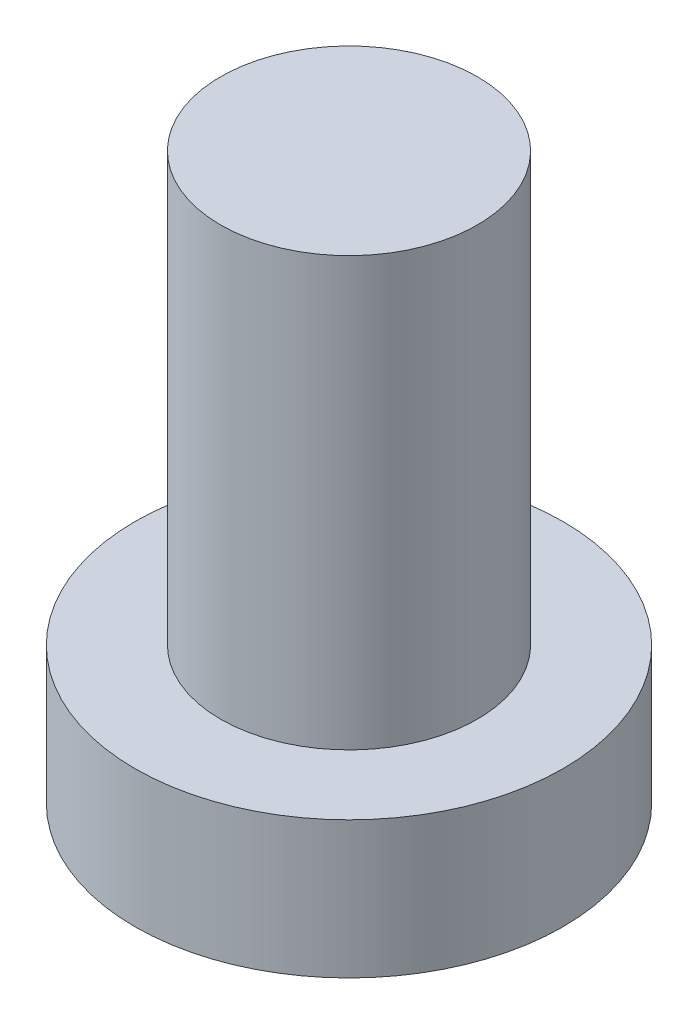
ISO-10303-21;
HEADER;
FILE_DESCRIPTION(('STEP AP214'),'2;1');
FILE_NAME('part.step','',(''),(''),'','','');
FILE_SCHEMA(('AUTOMOTIVE_DESIGN { 1 0 10303 214 1 1 1 1 }'));
ENDSEC;
DATA;
#1=APPLICATION_CONTEXT('core data for automotive mechanical design processes');
#2=APPLICATION_PROTOCOL_DEFINITION('international standard','automotive_design',2000,#1);
#3=PRODUCT_CONTEXT('',#1,'mechanical');
#4=PRODUCT('Part','Part','',(#3));
#5=PRODUCT_RELATED_PRODUCT_CATEGORY('part','',(#4));
#6=PRODUCT_DEFINITION_FORMATION('','',#4);
#7=PRODUCT_DEFINITION_CONTEXT('part definition',#1,'design');
#8=PRODUCT_DEFINITION('design','',#6,#7);
#9=PRODUCT_DEFINITION_SHAPE('','',#8);
#10=(LENGTH_UNIT() NAMED_UNIT(*) SI_UNIT(.MILLI.,.METRE.));
#11=(NAMED_UNIT(*) PLANE_ANGLE_UNIT() SI_UNIT($,.RADIAN.));
#12=(NAMED_UNIT(*) SI_UNIT($,.STERADIAN.) SOLID_ANGLE_UNIT());
#13=UNCERTAINTY_MEASURE_WITH_UNIT(LENGTH_MEASURE(1.E-05),#10,'distance_accuracy_value','');
#14=(GEOMETRIC_REPRESENTATION_CONTEXT(3) GLOBAL_UNCERTAINTY_ASSIGNED_CONTEXT((#13)) GLOBAL_UNIT_ASSIGNED_CONTEXT((#10,
#11,#12)) REPRESENTATION_CONTEXT('',''));
#15=CARTESIAN_POINT('',(0.,0.,0.));
#16=DIRECTION('',(0.,0.,1.));
#17=DIRECTION('',(1.,0.,0.));
#18=AXIS2_PLACEMENT_3D('',#15,#16,#17);
#19=CARTESIAN_POINT('',(0.,0.,0.));
#20=DIRECTION('',(0.,1.,0.));
#21=DIRECTION('',(0.,0.,1.));
#22=AXIS2_PLACEMENT_3D('',#19,#20,#21);
#23=PLANE('',#22);
#24=CARTESIAN_POINT('',(0.,0.,0.));
#25=DIRECTION('',(0.,1.,0.));
#26=DIRECTION('',(0.,0.,1.));
#27=AXIS2_PLACEMENT_3D('',#24,#25,#26);
#28=CIRCLE('',#27,2.5);
#29=CARTESIAN_POINT('',(0.,0.,2.5));
#30=VERTEX_POINT('',#29);
#31=EDGE_CURVE('E39',#30,#30,#28,.T.);
#32=ORIENTED_EDGE('',*,*,#31,.F.);
#33=EDGE_LOOP('',(#32));
#34=FACE_BOUND('',#33,.T.);
#35=CARTESIAN_POINT('',(1.,0.,1.));
#36=DIRECTION('',(0.,1.,0.));
#37=DIRECTION('',(0.,0.,-1.));
#38=AXIS2_PLACEMENT_3D('',#35,#36,#37);
#39=CIRCLE('',#38,0.5);
#40=CARTESIAN_POINT('',(1.,0.,0.5));
#41=VERTEX_POINT('',#40);
#42=CARTESIAN_POINT('',(0.5,0.,1.));
#43=VERTEX_POINT('',#42);
#44=EDGE_CURVE('E186',#41,#43,#39,.T.);
#45=ORIENTED_EDGE('',*,*,#44,.F.);
#46=DIRECTION('',(-1.,0.,0.));
#47=VECTOR('',#46,1.);
#48=CARTESIAN_POINT('',(1.,0.,0.5));
#49=LINE('',#48,#47);
#50=CARTESIAN_POINT('',(1.75,0.,0.5));
#51=VERTEX_POINT('',#50);
#52=EDGE_CURVE('E52',#51,#41,#49,.T.);
#53=ORIENTED_EDGE('',*,*,#52,.F.);
#54=DIRECTION('',(0.,0.,1.));
#55=VECTOR('',#54,1.);
#56=CARTESIAN_POINT('',(1.75,0.,-0.5));
#57=LINE('',#56,#55);
#58=CARTESIAN_POINT('',(1.75,0.,-0.5));
#59=VERTEX_POINT('',#58);
#60=EDGE_CURVE('E225',#59,#51,#57,.T.);
#61=ORIENTED_EDGE('',*,*,#60,.F.);
#62=DIRECTION('',(1.,0.,0.));
#63=VECTOR('',#62,1.);
#64=CARTESIAN_POINT('',(1.,0.,-0.5));
#65=LINE('',#64,#63);
#66=CARTESIAN_POINT('',(1.,0.,-0.5));
#67=VERTEX_POINT('',#66);
#68=EDGE_CURVE('E223',#67,#59,#65,.T.);
#69=ORIENTED_EDGE('',*,*,#68,.F.);
#70=CARTESIAN_POINT('',(1.,0.,-1.));
#71=DIRECTION('',(0.,1.,0.));
#72=DIRECTION('',(0.,0.,-1.));
#73=AXIS2_PLACEMENT_3D('',#70,#71,#72);
#74=CIRCLE('',#73,0.5);
#75=CARTESIAN_POINT('',(0.5,0.,-1.));
#76=VERTEX_POINT('',#75);
#77=EDGE_CURVE('E160',#76,#67,#74,.T.);
#78=ORIENTED_EDGE('',*,*,#77,.F.);
#79=DIRECTION('',(0.,0.,1.));
#80=VECTOR('',#79,1.);
#81=CARTESIAN_POINT('',(0.5,0.,-1.75));
#82=LINE('',#81,#80);
#83=CARTESIAN_POINT('',(0.5,0.,-1.75));
#84=VERTEX_POINT('',#83);
#85=EDGE_CURVE('E219',#84,#76,#82,.T.);
#86=ORIENTED_EDGE('',*,*,#85,.F.);
#87=DIRECTION('',(1.,0.,0.));
#88=VECTOR('',#87,1.);
#89=CARTESIAN_POINT('',(-0.5,0.,-1.75));
#90=LINE('',#89,#88);
#91=CARTESIAN_POINT('',(-0.5,0.,-1.75));
#92=VERTEX_POINT('',#91);
#93=EDGE_CURVE('E216',#92,#84,#90,.T.);
#94=ORIENTED_EDGE('',*,*,#93,.F.);
#95=DIRECTION('',(0.,0.,-1.));
#96=VECTOR('',#95,1.);
#97=CARTESIAN_POINT('',(-0.5,0.,-1.75));
#98=LINE('',#97,#96);
#99=CARTESIAN_POINT('',(-0.5,0.,-1.));
#100=VERTEX_POINT('',#99);
#101=EDGE_CURVE('E213',#100,#92,#98,.T.);
#102=ORIENTED_EDGE('',*,*,#101,.F.);
#103=CARTESIAN_POINT('',(-1.,0.,-1.));
#104=DIRECTION('',(0.,1.,0.));
#105=DIRECTION('',(0.,0.,-1.));
#106=AXIS2_PLACEMENT_3D('',#103,#104,#105);
#107=CIRCLE('',#106,0.5);
#108=CARTESIAN_POINT('',(-1.,0.,-0.5));
#109=VERTEX_POINT('',#108);
#110=EDGE_CURVE('E210',#109,#100,#107,.T.);
#111=ORIENTED_EDGE('',*,*,#110,.F.);
#112=DIRECTION('',(1.,0.,0.));
#113=VECTOR('',#112,1.);
#114=CARTESIAN_POINT('',(-1.75,0.,-0.5));
#115=LINE('',#114,#113);
#116=CARTESIAN_POINT('',(-1.75,0.,-0.5));
#117=VERTEX_POINT('',#116);
#118=EDGE_CURVE('E207',#117,#109,#115,.T.);
#119=ORIENTED_EDGE('',*,*,#118,.F.);
#120=DIRECTION('',(0.,0.,-1.));
#121=VECTOR('',#120,1.);
#122=CARTESIAN_POINT('',(-1.75,0.,-0.5));
#123=LINE('',#122,#121);
#124=CARTESIAN_POINT('',(-1.75,0.,0.5));
#125=VERTEX_POINT('',#124);
#126=EDGE_CURVE('E204',#125,#117,#123,.T.);
#127=ORIENTED_EDGE('',*,*,#126,.F.);
#128=DIRECTION('',(-1.,0.,0.));
#129=VECTOR('',#128,1.);
#130=CARTESIAN_POINT('',(-1.75,0.,0.5));
#131=LINE('',#130,#129);
#132=CARTESIAN_POINT('',(-1.,0.,0.5));
#133=VERTEX_POINT('',#132);
#134=EDGE_CURVE('E201',#133,#125,#131,.T.);
#135=ORIENTED_EDGE('',*,*,#134,.F.);
#136=CARTESIAN_POINT('',(-1.,0.,1.));
#137=DIRECTION('',(0.,1.,0.));
#138=DIRECTION('',(0.,0.,1.));
#139=AXIS2_PLACEMENT_3D('',#136,#137,#138);
#140=CIRCLE('',#139,0.5);
#141=CARTESIAN_POINT('',(-0.5,0.,1.));
#142=VERTEX_POINT('',#141);
#143=EDGE_CURVE('E198',#142,#133,#140,.T.);
#144=ORIENTED_EDGE('',*,*,#143,.F.);
#145=DIRECTION('',(0.,0.,-1.));
#146=VECTOR('',#145,1.);
#147=CARTESIAN_POINT('',(-0.5,0.,1.));
#148=LINE('',#147,#146);
#149=CARTESIAN_POINT('',(-0.5,0.,1.75));
#150=VERTEX_POINT('',#149);
#151=EDGE_CURVE('E195',#150,#142,#148,.T.);
#152=ORIENTED_EDGE('',*,*,#151,.F.);
#153=DIRECTION('',(-1.,0.,0.));
#154=VECTOR('',#153,1.);
#155=CARTESIAN_POINT('',(-0.5,0.,1.75));
#156=LINE('',#155,#154);
#157=CARTESIAN_POINT('',(0.5,0.,1.75));
#158=VERTEX_POINT('',#157);
#159=EDGE_CURVE('E192',#158,#150,#156,.T.);
#160=ORIENTED_EDGE('',*,*,#159,.F.);
#161=DIRECTION('',(0.,0.,1.));
#162=VECTOR('',#161,1.);
#163=CARTESIAN_POINT('',(0.5,0.,1.));
#164=LINE('',#163,#162);
#165=EDGE_CURVE('E189',#43,#158,#164,.T.);
#166=ORIENTED_EDGE('',*,*,#165,.F.);
#167=EDGE_LOOP('',(#45,#53,#61,#69,#78,#86,#94,#102,#111,#119,#127,#135,#144,#152,#160,#166));
#168=FACE_BOUND('',#167,.T.);
#169=ADVANCED_FACE('F35',(#34,#168),#23,.F.);
#170=CARTESIAN_POINT('',(0.,1.6,0.));
#171=DIRECTION('',(0.,-1.,0.));
#172=DIRECTION('',(0.,0.,-1.));
#173=AXIS2_PLACEMENT_3D('',#170,#171,#172);
#174=CYLINDRICAL_SURFACE('',#173,2.5);
#175=CARTESIAN_POINT('',(0.,1.6,0.));
#176=DIRECTION('',(0.,1.,0.));
#177=DIRECTION('',(0.,0.,1.));
#178=AXIS2_PLACEMENT_3D('',#175,#176,#177);
#179=CIRCLE('',#178,2.5);
#180=CARTESIAN_POINT('',(0.,1.6,2.5));
#181=VERTEX_POINT('',#180);
#182=EDGE_CURVE('E44',#181,#181,#179,.T.);
#183=ORIENTED_EDGE('',*,*,#182,.F.);
#184=EDGE_LOOP('',(#183));
#185=FACE_BOUND('',#184,.T.);
#186=ORIENTED_EDGE('',*,*,#31,.T.);
#187=EDGE_LOOP('',(#186));
#188=FACE_BOUND('',#187,.T.);
#189=ADVANCED_FACE('F37',(#185,#188),#174,.T.);
#190=CARTESIAN_POINT('',(0.,1.6,0.));
#191=DIRECTION('',(0.,1.,0.));
#192=DIRECTION('',(0.,0.,1.));
#193=AXIS2_PLACEMENT_3D('',#190,#191,#192);
#194=PLANE('',#193);
#195=CARTESIAN_POINT('',(0.,1.6,0.));
#196=DIRECTION('',(0.,1.,0.));
#197=DIRECTION('',(0.,0.,1.));
#198=AXIS2_PLACEMENT_3D('',#195,#196,#197);
#199=CIRCLE('',#198,1.5);
#200=CARTESIAN_POINT('',(0.,1.6,1.5));
#201=VERTEX_POINT('',#200);
#202=EDGE_CURVE('E11',#201,#201,#199,.T.);
#203=ORIENTED_EDGE('',*,*,#202,.F.);
#204=EDGE_LOOP('',(#203));
#205=FACE_BOUND('',#204,.T.);
#206=ORIENTED_EDGE('',*,*,#182,.T.);
#207=EDGE_LOOP('',(#206));
#208=FACE_BOUND('',#207,.T.);
#209=ADVANCED_FACE('F374',(#205,#208),#194,.T.);
#210=CARTESIAN_POINT('',(0.,6.6,0.));
#211=DIRECTION('',(0.,-1.,0.));
#212=DIRECTION('',(0.,0.,-1.));
#213=AXIS2_PLACEMENT_3D('',#210,#211,#212);
#214=CYLINDRICAL_SURFACE('',#213,1.5);
#215=CARTESIAN_POINT('',(0.,6.6,0.));
#216=DIRECTION('',(0.,1.,0.));
#217=DIRECTION('',(0.,0.,1.));
#218=AXIS2_PLACEMENT_3D('',#215,#216,#217);
#219=CIRCLE('',#218,1.5);
#220=CARTESIAN_POINT('',(0.,6.6,1.5));
#221=VERTEX_POINT('',#220);
#222=EDGE_CURVE('E229',#221,#221,#219,.T.);
#223=ORIENTED_EDGE('',*,*,#222,.F.);
#224=EDGE_LOOP('',(#223));
#225=FACE_BOUND('',#224,.T.);
#226=ORIENTED_EDGE('',*,*,#202,.T.);
#227=EDGE_LOOP('',(#226));
#228=FACE_BOUND('',#227,.T.);
#229=ADVANCED_FACE('F370',(#225,#228),#214,.T.);
#230=CARTESIAN_POINT('',(0.,6.6,0.));
#231=DIRECTION('',(0.,1.,0.));
#232=DIRECTION('',(0.,0.,1.));
#233=AXIS2_PLACEMENT_3D('',#230,#231,#232);
#234=PLANE('',#233);
#235=ORIENTED_EDGE('',*,*,#222,.T.);
#236=EDGE_LOOP('',(#235));
#237=FACE_BOUND('',#236,.T.);
#238=ADVANCED_FACE('F320',(#237),#234,.T.);
#239=CARTESIAN_POINT('',(1.,1.,0.5));
#240=DIRECTION('',(0.,0.,1.));
#241=DIRECTION('',(1.,0.,0.));
#242=AXIS2_PLACEMENT_3D('',#239,#240,#241);
#243=PLANE('',#242);
#244=ORIENTED_EDGE('',*,*,#52,.T.);
#245=DIRECTION('',(0.,-1.,0.));
#246=VECTOR('',#245,1.);
#247=CARTESIAN_POINT('',(1.,1.,0.5));
#248=LINE('',#247,#246);
#249=CARTESIAN_POINT('',(1.,1.,0.5));
#250=VERTEX_POINT('',#249);
#251=EDGE_CURVE('E112',#250,#41,#248,.T.);
#252=ORIENTED_EDGE('',*,*,#251,.F.);
#253=DIRECTION('',(-1.,0.,0.));
#254=VECTOR('',#253,1.);
#255=CARTESIAN_POINT('',(1.,1.,0.5));
#256=LINE('',#255,#254);
#257=CARTESIAN_POINT('',(1.75,1.,0.5));
#258=VERTEX_POINT('',#257);
#259=EDGE_CURVE('E227',#258,#250,#256,.T.);
#260=ORIENTED_EDGE('',*,*,#259,.F.);
#261=DIRECTION('',(0.,-1.,0.));
#262=VECTOR('',#261,1.);
#263=CARTESIAN_POINT('',(1.75,1.,0.5));
#264=LINE('',#263,#262);
#265=EDGE_CURVE('E60',#258,#51,#264,.T.);
#266=ORIENTED_EDGE('',*,*,#265,.T.);
#267=EDGE_LOOP('',(#244,#252,#260,#266));
#268=FACE_BOUND('',#267,.T.);
#269=ADVANCED_FACE('F313',(#268),#243,.F.);
#270=CARTESIAN_POINT('',(1.75,1.,-0.5));
#271=DIRECTION('',(1.,0.,0.));
#272=DIRECTION('',(0.,0.,-1.));
#273=AXIS2_PLACEMENT_3D('',#270,#271,#272);
#274=PLANE('',#273);
#275=ORIENTED_EDGE('',*,*,#60,.T.);
#276=ORIENTED_EDGE('',*,*,#265,.F.);
#277=DIRECTION('',(0.,0.,1.));
#278=VECTOR('',#277,1.);
#279=CARTESIAN_POINT('',(1.75,1.,-0.5));
#280=LINE('',#279,#278);
#281=CARTESIAN_POINT('',(1.75,1.,-0.5));
#282=VERTEX_POINT('',#281);
#283=EDGE_CURVE('E172',#282,#258,#280,.T.);
#284=ORIENTED_EDGE('',*,*,#283,.F.);
#285=DIRECTION('',(0.,-1.,0.));
#286=VECTOR('',#285,1.);
#287=CARTESIAN_POINT('',(1.75,1.,-0.5));
#288=LINE('',#287,#286);
#289=EDGE_CURVE('E164',#282,#59,#288,.T.);
#290=ORIENTED_EDGE('',*,*,#289,.T.);
#291=EDGE_LOOP('',(#275,#276,#284,#290));
#292=FACE_BOUND('',#291,.T.);
#293=ADVANCED_FACE('F311',(#292),#274,.F.);
#294=CARTESIAN_POINT('',(1.,1.,-0.5));
#295=DIRECTION('',(0.,0.,-1.));
#296=DIRECTION('',(-1.,0.,0.));
#297=AXIS2_PLACEMENT_3D('',#294,#295,#296);
#298=PLANE('',#297);
#299=ORIENTED_EDGE('',*,*,#68,.T.);
#300=ORIENTED_EDGE('',*,*,#289,.F.);
#301=DIRECTION('',(1.,0.,0.));
#302=VECTOR('',#301,1.);
#303=CARTESIAN_POINT('',(1.,1.,-0.5));
#304=LINE('',#303,#302);
#305=CARTESIAN_POINT('',(1.,1.,-0.5));
#306=VERTEX_POINT('',#305);
#307=EDGE_CURVE('E168',#306,#282,#304,.T.);
#308=ORIENTED_EDGE('',*,*,#307,.F.);
#309=DIRECTION('',(0.,-1.,0.));
#310=VECTOR('',#309,1.);
#311=CARTESIAN_POINT('',(1.,1.,-0.5));
#312=LINE('',#311,#310);
#313=EDGE_CURVE('E153',#306,#67,#312,.T.);
#314=ORIENTED_EDGE('',*,*,#313,.T.);
#315=EDGE_LOOP('',(#299,#300,#308,#314));
#316=FACE_BOUND('',#315,.T.);
#317=ADVANCED_FACE('F169',(#316),#298,.F.);
#318=CARTESIAN_POINT('',(1.,1.,-1.));
#319=DIRECTION('',(0.,-1.,0.));
#320=DIRECTION('',(0.,0.,-1.));
#321=AXIS2_PLACEMENT_3D('',#318,#319,#320);
#322=CYLINDRICAL_SURFACE('',#321,0.5);
#323=ORIENTED_EDGE('',*,*,#77,.T.);
#324=ORIENTED_EDGE('',*,*,#313,.F.);
#325=CARTESIAN_POINT('',(1.,1.,-1.));
#326=DIRECTION('',(0.,1.,0.));
#327=DIRECTION('',(0.,0.,-1.));
#328=AXIS2_PLACEMENT_3D('',#325,#326,#327);
#329=CIRCLE('',#328,0.5);
#330=CARTESIAN_POINT('',(0.5,1.,-1.));
#331=VERTEX_POINT('',#330);
#332=EDGE_CURVE('E157',#331,#306,#329,.T.);
#333=ORIENTED_EDGE('',*,*,#332,.F.);
#334=DIRECTION('',(0.,-1.,0.));
#335=VECTOR('',#334,1.);
#336=CARTESIAN_POINT('',(0.5,1.,-1.));
#337=LINE('',#336,#335);
#338=EDGE_CURVE('E165',#331,#76,#337,.T.);
#339=ORIENTED_EDGE('',*,*,#338,.T.);
#340=EDGE_LOOP('',(#323,#324,#333,#339));
#341=FACE_BOUND('',#340,.T.);
#342=ADVANCED_FACE('F155',(#341),#322,.T.);
#343=CARTESIAN_POINT('',(0.5,1.,-1.75));
#344=DIRECTION('',(1.,0.,0.));
#345=DIRECTION('',(0.,0.,-1.));
#346=AXIS2_PLACEMENT_3D('',#343,#344,#345);
#347=PLANE('',#346);
#348=ORIENTED_EDGE('',*,*,#85,.T.);
#349=ORIENTED_EDGE('',*,*,#338,.F.);
#350=DIRECTION('',(0.,0.,1.));
#351=VECTOR('',#350,1.);
#352=CARTESIAN_POINT('',(0.5,1.,-1.75));
#353=LINE('',#352,#351);
#354=CARTESIAN_POINT('',(0.5,1.,-1.75));
#355=VERTEX_POINT('',#354);
#356=EDGE_CURVE('E178',#355,#331,#353,.T.);
#357=ORIENTED_EDGE('',*,*,#356,.F.);
#358=DIRECTION('',(0.,-1.,0.));
#359=VECTOR('',#358,1.);
#360=CARTESIAN_POINT('',(0.5,1.,-1.75));
#361=LINE('',#360,#359);
#362=EDGE_CURVE('E232',#355,#84,#361,.T.);
#363=ORIENTED_EDGE('',*,*,#362,.T.);
#364=EDGE_LOOP('',(#348,#349,#357,#363));
#365=FACE_BOUND('',#364,.T.);
#366=ADVANCED_FACE('F310',(#365),#347,.F.);
#367=CARTESIAN_POINT('',(-0.5,1.,-1.75));
#368=DIRECTION('',(0.,0.,-1.));
#369=DIRECTION('',(-1.,0.,0.));
#370=AXIS2_PLACEMENT_3D('',#367,#368,#369);
#371=PLANE('',#370);
#372=ORIENTED_EDGE('',*,*,#93,.T.);
#373=ORIENTED_EDGE('',*,*,#362,.F.);
#374=DIRECTION('',(1.,0.,0.));
#375=VECTOR('',#374,1.);
#376=CARTESIAN_POINT('',(-0.5,1.,-1.75));
#377=LINE('',#376,#375);
#378=CARTESIAN_POINT('',(-0.5,1.,-1.75));
#379=VERTEX_POINT('',#378);
#380=EDGE_CURVE('E180',#379,#355,#377,.T.);
#381=ORIENTED_EDGE('',*,*,#380,.F.);
#382=DIRECTION('',(0.,-1.,0.));
#383=VECTOR('',#382,1.);
#384=CARTESIAN_POINT('',(-0.5,1.,-1.75));
#385=LINE('',#384,#383);
#386=EDGE_CURVE('E234',#379,#92,#385,.T.);
#387=ORIENTED_EDGE('',*,*,#386,.T.);
#388=EDGE_LOOP('',(#372,#373,#381,#387));
#389=FACE_BOUND('',#388,.T.);
#390=ADVANCED_FACE('F306',(#389),#371,.F.);
#391=CARTESIAN_POINT('',(-0.5,1.,-1.75));
#392=DIRECTION('',(-1.,0.,0.));
#393=DIRECTION('',(0.,0.,1.));
#394=AXIS2_PLACEMENT_3D('',#391,#392,#393);
#395=PLANE('',#394);
#396=ORIENTED_EDGE('',*,*,#101,.T.);
#397=ORIENTED_EDGE('',*,*,#386,.F.);
#398=DIRECTION('',(0.,0.,-1.));
#399=VECTOR('',#398,1.);
#400=CARTESIAN_POINT('',(-0.5,1.,-1.75));
#401=LINE('',#400,#399);
#402=CARTESIAN_POINT('',(-0.5,1.,-1.));
#403=VERTEX_POINT('',#402);
#404=EDGE_CURVE('E301',#403,#379,#401,.T.);
#405=ORIENTED_EDGE('',*,*,#404,.F.);
#406=DIRECTION('',(0.,-1.,0.));
#407=VECTOR('',#406,1.);
#408=CARTESIAN_POINT('',(-0.5,1.,-1.));
#409=LINE('',#408,#407);
#410=EDGE_CURVE('E236',#403,#100,#409,.T.);
#411=ORIENTED_EDGE('',*,*,#410,.T.);
#412=EDGE_LOOP('',(#396,#397,#405,#411));
#413=FACE_BOUND('',#412,.T.);
#414=ADVANCED_FACE('F330',(#413),#395,.F.);
#415=CARTESIAN_POINT('',(-1.,1.,-1.));
#416=DIRECTION('',(0.,-1.,0.));
#417=DIRECTION('',(0.,0.,-1.));
#418=AXIS2_PLACEMENT_3D('',#415,#416,#417);
#419=CYLINDRICAL_SURFACE('',#418,0.5);
#420=ORIENTED_EDGE('',*,*,#110,.T.);
#421=ORIENTED_EDGE('',*,*,#410,.F.);
#422=CARTESIAN_POINT('',(-1.,1.,-1.));
#423=DIRECTION('',(0.,1.,0.));
#424=DIRECTION('',(0.,0.,-1.));
#425=AXIS2_PLACEMENT_3D('',#422,#423,#424);
#426=CIRCLE('',#425,0.5);
#427=CARTESIAN_POINT('',(-1.,1.,-0.5));
#428=VERTEX_POINT('',#427);
#429=EDGE_CURVE('E298',#428,#403,#426,.T.);
#430=ORIENTED_EDGE('',*,*,#429,.F.);
#431=DIRECTION('',(0.,-1.,0.));
#432=VECTOR('',#431,1.);
#433=CARTESIAN_POINT('',(-1.,1.,-0.5));
#434=LINE('',#433,#432);
#435=EDGE_CURVE('E238',#428,#109,#434,.T.);
#436=ORIENTED_EDGE('',*,*,#435,.T.);
#437=EDGE_LOOP('',(#420,#421,#430,#436));
#438=FACE_BOUND('',#437,.T.);
#439=ADVANCED_FACE('F333',(#438),#419,.T.);
#440=CARTESIAN_POINT('',(-1.75,1.,-0.5));
#441=DIRECTION('',(0.,0.,-1.));
#442=DIRECTION('',(-1.,0.,0.));
#443=AXIS2_PLACEMENT_3D('',#440,#441,#442);
#444=PLANE('',#443);
#445=ORIENTED_EDGE('',*,*,#118,.T.);
#446=ORIENTED_EDGE('',*,*,#435,.F.);
#447=DIRECTION('',(1.,0.,0.));
#448=VECTOR('',#447,1.);
#449=CARTESIAN_POINT('',(-1.75,1.,-0.5));
#450=LINE('',#449,#448);
#451=CARTESIAN_POINT('',(-1.75,1.,-0.5));
#452=VERTEX_POINT('',#451);
#453=EDGE_CURVE('E295',#452,#428,#450,.T.);
#454=ORIENTED_EDGE('',*,*,#453,.F.);
#455=DIRECTION('',(0.,-1.,0.));
#456=VECTOR('',#455,1.);
#457=CARTESIAN_POINT('',(-1.75,1.,-0.5));
#458=LINE('',#457,#456);
#459=EDGE_CURVE('E240',#452,#117,#458,.T.);
#460=ORIENTED_EDGE('',*,*,#459,.T.);
#461=EDGE_LOOP('',(#445,#446,#454,#460));
#462=FACE_BOUND('',#461,.T.);
#463=ADVANCED_FACE('F337',(#462),#444,.F.);
#464=CARTESIAN_POINT('',(-1.75,1.,-0.5));
#465=DIRECTION('',(-1.,0.,0.));
#466=DIRECTION('',(0.,0.,1.));
#467=AXIS2_PLACEMENT_3D('',#464,#465,#466);
#468=PLANE('',#467);
#469=ORIENTED_EDGE('',*,*,#126,.T.);
#470=ORIENTED_EDGE('',*,*,#459,.F.);
#471=DIRECTION('',(0.,0.,-1.));
#472=VECTOR('',#471,1.);
#473=CARTESIAN_POINT('',(-1.75,1.,-0.5));
#474=LINE('',#473,#472);
#475=CARTESIAN_POINT('',(-1.75,1.,0.5));
#476=VERTEX_POINT('',#475);
#477=EDGE_CURVE('E292',#476,#452,#474,.T.);
#478=ORIENTED_EDGE('',*,*,#477,.F.);
#479=DIRECTION('',(0.,-1.,0.));
#480=VECTOR('',#479,1.);
#481=CARTESIAN_POINT('',(-1.75,1.,0.5));
#482=LINE('',#481,#480);
#483=EDGE_CURVE('E242',#476,#125,#482,.T.);
#484=ORIENTED_EDGE('',*,*,#483,.T.);
#485=EDGE_LOOP('',(#469,#470,#478,#484));
#486=FACE_BOUND('',#485,.T.);
#487=ADVANCED_FACE('F341',(#486),#468,.F.);
#488=CARTESIAN_POINT('',(-1.75,1.,0.5));
#489=DIRECTION('',(0.,0.,1.));
#490=DIRECTION('',(1.,0.,0.));
#491=AXIS2_PLACEMENT_3D('',#488,#489,#490);
#492=PLANE('',#491);
#493=ORIENTED_EDGE('',*,*,#134,.T.);
#494=ORIENTED_EDGE('',*,*,#483,.F.);
#495=DIRECTION('',(-1.,0.,0.));
#496=VECTOR('',#495,1.);
#497=CARTESIAN_POINT('',(-1.75,1.,0.5));
#498=LINE('',#497,#496);
#499=CARTESIAN_POINT('',(-1.,1.,0.5));
#500=VERTEX_POINT('',#499);
#501=EDGE_CURVE('E289',#500,#476,#498,.T.);
#502=ORIENTED_EDGE('',*,*,#501,.F.);
#503=DIRECTION('',(0.,-1.,0.));
#504=VECTOR('',#503,1.);
#505=CARTESIAN_POINT('',(-1.,1.,0.5));
#506=LINE('',#505,#504);
#507=EDGE_CURVE('E244',#500,#133,#506,.T.);
#508=ORIENTED_EDGE('',*,*,#507,.T.);
#509=EDGE_LOOP('',(#493,#494,#502,#508));
#510=FACE_BOUND('',#509,.T.);
#511=ADVANCED_FACE('F345',(#510),#492,.F.);
#512=CARTESIAN_POINT('',(-1.,1.,1.));
#513=DIRECTION('',(0.,-1.,0.));
#514=DIRECTION('',(0.,0.,-1.));
#515=AXIS2_PLACEMENT_3D('',#512,#513,#514);
#516=CYLINDRICAL_SURFACE('',#515,0.5);
#517=ORIENTED_EDGE('',*,*,#143,.T.);
#518=ORIENTED_EDGE('',*,*,#507,.F.);
#519=CARTESIAN_POINT('',(-1.,1.,1.));
#520=DIRECTION('',(0.,1.,0.));
#521=DIRECTION('',(0.,0.,1.));
#522=AXIS2_PLACEMENT_3D('',#519,#520,#521);
#523=CIRCLE('',#522,0.5);
#524=CARTESIAN_POINT('',(-0.5,1.,1.));
#525=VERTEX_POINT('',#524);
#526=EDGE_CURVE('E286',#525,#500,#523,.T.);
#527=ORIENTED_EDGE('',*,*,#526,.F.);
#528=DIRECTION('',(0.,-1.,0.));
#529=VECTOR('',#528,1.);
#530=CARTESIAN_POINT('',(-0.5,1.,1.));
#531=LINE('',#530,#529);
#532=EDGE_CURVE('E246',#525,#142,#531,.T.);
#533=ORIENTED_EDGE('',*,*,#532,.T.);
#534=EDGE_LOOP('',(#517,#518,#527,#533));
#535=FACE_BOUND('',#534,.T.);
#536=ADVANCED_FACE('F349',(#535),#516,.T.);
#537=CARTESIAN_POINT('',(-0.5,1.,1.));
#538=DIRECTION('',(-1.,0.,0.));
#539=DIRECTION('',(0.,0.,1.));
#540=AXIS2_PLACEMENT_3D('',#537,#538,#539);
#541=PLANE('',#540);
#542=ORIENTED_EDGE('',*,*,#151,.T.);
#543=ORIENTED_EDGE('',*,*,#532,.F.);
#544=DIRECTION('',(0.,0.,-1.));
#545=VECTOR('',#544,1.);
#546=CARTESIAN_POINT('',(-0.5,1.,1.));
#547=LINE('',#546,#545);
#548=CARTESIAN_POINT('',(-0.5,1.,1.75));
#549=VERTEX_POINT('',#548);
#550=EDGE_CURVE('E283',#549,#525,#547,.T.);
#551=ORIENTED_EDGE('',*,*,#550,.F.);
#552=DIRECTION('',(0.,-1.,0.));
#553=VECTOR('',#552,1.);
#554=CARTESIAN_POINT('',(-0.5,1.,1.75));
#555=LINE('',#554,#553);
#556=EDGE_CURVE('E248',#549,#150,#555,.T.);
#557=ORIENTED_EDGE('',*,*,#556,.T.);
#558=EDGE_LOOP('',(#542,#543,#551,#557));
#559=FACE_BOUND('',#558,.T.);
#560=ADVANCED_FACE('F353',(#559),#541,.F.);
#561=CARTESIAN_POINT('',(-0.5,1.,1.75));
#562=DIRECTION('',(0.,0.,1.));
#563=DIRECTION('',(1.,0.,0.));
#564=AXIS2_PLACEMENT_3D('',#561,#562,#563);
#565=PLANE('',#564);
#566=ORIENTED_EDGE('',*,*,#159,.T.);
#567=ORIENTED_EDGE('',*,*,#556,.F.);
#568=DIRECTION('',(-1.,0.,0.));
#569=VECTOR('',#568,1.);
#570=CARTESIAN_POINT('',(-0.5,1.,1.75));
#571=LINE('',#570,#569);
#572=CARTESIAN_POINT('',(0.5,1.,1.75));
#573=VERTEX_POINT('',#572);
#574=EDGE_CURVE('E280',#573,#549,#571,.T.);
#575=ORIENTED_EDGE('',*,*,#574,.F.);
#576=DIRECTION('',(0.,-1.,0.));
#577=VECTOR('',#576,1.);
#578=CARTESIAN_POINT('',(0.5,1.,1.75));
#579=LINE('',#578,#577);
#580=EDGE_CURVE('E250',#573,#158,#579,.T.);
#581=ORIENTED_EDGE('',*,*,#580,.T.);
#582=EDGE_LOOP('',(#566,#567,#575,#581));
#583=FACE_BOUND('',#582,.T.);
#584=ADVANCED_FACE('F357',(#583),#565,.F.);
#585=CARTESIAN_POINT('',(0.5,1.,1.));
#586=DIRECTION('',(1.,0.,0.));
#587=DIRECTION('',(0.,0.,-1.));
#588=AXIS2_PLACEMENT_3D('',#585,#586,#587);
#589=PLANE('',#588);
#590=ORIENTED_EDGE('',*,*,#165,.T.);
#591=ORIENTED_EDGE('',*,*,#580,.F.);
#592=DIRECTION('',(0.,0.,1.));
#593=VECTOR('',#592,1.);
#594=CARTESIAN_POINT('',(0.5,1.,1.));
#595=LINE('',#594,#593);
#596=CARTESIAN_POINT('',(0.5,1.,1.));
#597=VERTEX_POINT('',#596);
#598=EDGE_CURVE('E275',#597,#573,#595,.T.);
#599=ORIENTED_EDGE('',*,*,#598,.F.);
#600=DIRECTION('',(0.,-1.,0.));
#601=VECTOR('',#600,1.);
#602=CARTESIAN_POINT('',(0.5,1.,1.));
#603=LINE('',#602,#601);
#604=EDGE_CURVE('E252',#597,#43,#603,.T.);
#605=ORIENTED_EDGE('',*,*,#604,.T.);
#606=EDGE_LOOP('',(#590,#591,#599,#605));
#607=FACE_BOUND('',#606,.T.);
#608=ADVANCED_FACE('F361',(#607),#589,.F.);
#609=CARTESIAN_POINT('',(1.,1.,1.));
#610=DIRECTION('',(0.,-1.,0.));
#611=DIRECTION('',(0.,0.,-1.));
#612=AXIS2_PLACEMENT_3D('',#609,#610,#611);
#613=CYLINDRICAL_SURFACE('',#612,0.5);
#614=ORIENTED_EDGE('',*,*,#44,.T.);
#615=ORIENTED_EDGE('',*,*,#604,.F.);
#616=CARTESIAN_POINT('',(1.,1.,1.));
#617=DIRECTION('',(0.,1.,0.));
#618=DIRECTION('',(0.,0.,-1.));
#619=AXIS2_PLACEMENT_3D('',#616,#617,#618);
#620=CIRCLE('',#619,0.5);
#621=EDGE_CURVE('E273',#250,#597,#620,.T.);
#622=ORIENTED_EDGE('',*,*,#621,.F.);
#623=ORIENTED_EDGE('',*,*,#251,.T.);
#624=EDGE_LOOP('',(#614,#615,#622,#623));
#625=FACE_BOUND('',#624,.T.);
#626=ADVANCED_FACE('F270',(#625),#613,.T.);
#627=CARTESIAN_POINT('',(1.,1.,-1.));
#628=DIRECTION('',(0.,-1.,0.));
#629=DIRECTION('',(0.,0.,-1.));
#630=AXIS2_PLACEMENT_3D('',#627,#628,#629);
#631=PLANE('',#630);
#632=ORIENTED_EDGE('',*,*,#259,.T.);
#633=ORIENTED_EDGE('',*,*,#621,.T.);
#634=ORIENTED_EDGE('',*,*,#598,.T.);
#635=ORIENTED_EDGE('',*,*,#574,.T.);
#636=ORIENTED_EDGE('',*,*,#550,.T.);
#637=ORIENTED_EDGE('',*,*,#526,.T.);
#638=ORIENTED_EDGE('',*,*,#501,.T.);
#639=ORIENTED_EDGE('',*,*,#477,.T.);
#640=ORIENTED_EDGE('',*,*,#453,.T.);
#641=ORIENTED_EDGE('',*,*,#429,.T.);
#642=ORIENTED_EDGE('',*,*,#404,.T.);
#643=ORIENTED_EDGE('',*,*,#380,.T.);
#644=ORIENTED_EDGE('',*,*,#356,.T.);
#645=ORIENTED_EDGE('',*,*,#332,.T.);
#646=ORIENTED_EDGE('',*,*,#307,.T.);
#647=ORIENTED_EDGE('',*,*,#283,.T.);
#648=EDGE_LOOP('',(#632,#633,#634,#635,#636,#637,#638,#639,#640,#641,#642,#643,#644,#645,#646,#647));
#649=FACE_BOUND('',#648,.T.);
#650=ADVANCED_FACE('F175',(#649),#631,.T.);
#651=CLOSED_SHELL('',(#169,#189,#209,#229,#238,#269,#293,#317,#342,#366,#390,#414,#439,#463,
#487,#511,#536,#560,#584,#608,#626,#650));
#652=MANIFOLD_SOLID_BREP('B2',#651);
#653=ADVANCED_BREP_SHAPE_REPRESENTATION('',(#18,#652),#14);
#654=SHAPE_DEFINITION_REPRESENTATION(#9,#653);
ENDSEC;
END-ISO-10303-21;
